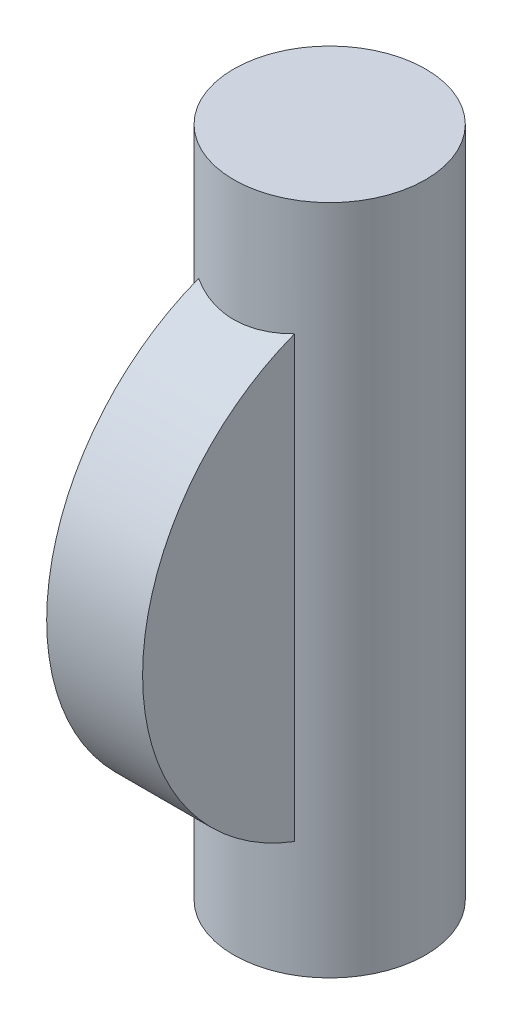
ISO-10303-21;
HEADER;
FILE_DESCRIPTION(('STEP AP214'),'2;1');
FILE_NAME('part.step','',(''),(''),'','','');
FILE_SCHEMA(('AUTOMOTIVE_DESIGN { 1 0 10303 214 1 1 1 1 }'));
ENDSEC;
DATA;
#1=APPLICATION_CONTEXT('core data for automotive mechanical design processes');
#2=APPLICATION_PROTOCOL_DEFINITION('international standard','automotive_design',2000,#1);
#3=PRODUCT_CONTEXT('',#1,'mechanical');
#4=PRODUCT('Part','Part','',(#3));
#5=PRODUCT_RELATED_PRODUCT_CATEGORY('part','',(#4));
#6=PRODUCT_DEFINITION_FORMATION('','',#4);
#7=PRODUCT_DEFINITION_CONTEXT('part definition',#1,'design');
#8=PRODUCT_DEFINITION('design','',#6,#7);
#9=PRODUCT_DEFINITION_SHAPE('','',#8);
#10=(LENGTH_UNIT() NAMED_UNIT(*) SI_UNIT(.MILLI.,.METRE.));
#11=(NAMED_UNIT(*) PLANE_ANGLE_UNIT() SI_UNIT($,.RADIAN.));
#12=(NAMED_UNIT(*) SI_UNIT($,.STERADIAN.) SOLID_ANGLE_UNIT());
#13=UNCERTAINTY_MEASURE_WITH_UNIT(LENGTH_MEASURE(1.E-05),#10,'distance_accuracy_value','');
#14=(GEOMETRIC_REPRESENTATION_CONTEXT(3) GLOBAL_UNCERTAINTY_ASSIGNED_CONTEXT((#13)) GLOBAL_UNIT_ASSIGNED_CONTEXT((#10,
#11,#12)) REPRESENTATION_CONTEXT('',''));
#15=CARTESIAN_POINT('',(0.,0.,0.));
#16=DIRECTION('',(0.,0.,1.));
#17=DIRECTION('',(1.,0.,0.));
#18=AXIS2_PLACEMENT_3D('',#15,#16,#17);
#19=CARTESIAN_POINT('',(0.,17.78,0.));
#20=DIRECTION('',(0.,-1.,0.));
#21=DIRECTION('',(0.,0.,-1.));
#22=AXIS2_PLACEMENT_3D('',#19,#20,#21);
#23=CYLINDRICAL_SURFACE('',#22,2.54);
#24=CARTESIAN_POINT('',(0.,0.,0.));
#25=DIRECTION('',(0.,1.,0.));
#26=DIRECTION('',(0.,0.,1.));
#27=AXIS2_PLACEMENT_3D('',#24,#25,#26);
#28=CIRCLE('',#27,2.54);
#29=CARTESIAN_POINT('',(0.,0.,2.54));
#30=VERTEX_POINT('',#29);
#31=EDGE_CURVE('E101',#30,#30,#28,.T.);
#32=ORIENTED_EDGE('',*,*,#31,.T.);
#33=EDGE_LOOP('',(#32));
#34=FACE_BOUND('',#33,.T.);
#35=CARTESIAN_POINT('',(0.,17.78,0.));
#36=DIRECTION('',(0.,1.,0.));
#37=DIRECTION('',(0.,0.,1.));
#38=AXIS2_PLACEMENT_3D('',#35,#36,#37);
#39=CIRCLE('',#38,2.54);
#40=CARTESIAN_POINT('',(0.,17.78,2.54));
#41=VERTEX_POINT('',#40);
#42=EDGE_CURVE('E65',#41,#41,#39,.T.);
#43=ORIENTED_EDGE('',*,*,#42,.F.);
#44=EDGE_LOOP('',(#43));
#45=FACE_BOUND('',#44,.T.);
#46=DIRECTION('',(0.,-1.,0.));
#47=VECTOR('',#46,1.);
#48=CARTESIAN_POINT('',(-1.27,17.78,2.19970452561247));
#49=LINE('',#48,#47);
#50=CARTESIAN_POINT('',(-1.27,14.7112566512738,2.19970452561247));
#51=VERTEX_POINT('',#50);
#52=CARTESIAN_POINT('',(-1.27,3.06874334872615,2.19970452561247));
#53=VERTEX_POINT('',#52);
#54=EDGE_CURVE('E11',#51,#53,#49,.T.);
#55=ORIENTED_EDGE('',*,*,#54,.F.);
#56=CARTESIAN_POINT('',(0.,14.5710323885716,-2.54));
#57=CARTESIAN_POINT('',(-0.0679155655720305,14.5710337146344,-2.53999844050646));
#58=CARTESIAN_POINT('',(-0.135853569762148,14.5722558814735,-2.5372703167691));
#59=CARTESIAN_POINT('',(-0.271221226461333,14.5770987997238,-2.52639338906266));
#60=CARTESIAN_POINT('',(-0.338650534826577,14.5807210493114,-2.51824119927744));
#61=CARTESIAN_POINT('',(-0.539693567418974,14.5950507345168,-2.48570637087482));
#62=CARTESIAN_POINT('',(-0.671856275803724,14.6092205973638,-2.45324576747276));
#63=CARTESIAN_POINT('',(-0.927802215521276,14.6448991388758,-2.36831960375434));
#64=CARTESIAN_POINT('',(-1.05161640518304,14.6663786878879,-2.31593335260028));
#65=CARTESIAN_POINT('',(-1.28869168847588,14.7142056937984,-2.1928755843071));
#66=CARTESIAN_POINT('',(-1.40195556531598,14.7405518613638,-2.12220890829366));
#67=CARTESIAN_POINT('',(-1.62150470841532,14.796905118006,-1.96008701428142));
#68=CARTESIAN_POINT('',(-1.72708119218214,14.8270331416588,-1.86771414327507));
#69=CARTESIAN_POINT('',(-1.92176793364219,14.8865587708278,-1.66673065906509));
#70=CARTESIAN_POINT('',(-2.01087199039026,14.9159560976877,-1.55811395869108));
#71=CARTESIAN_POINT('',(-2.17364166423992,14.9721676220868,-1.32221208425154));
#72=CARTESIAN_POINT('',(-2.2465170854779,14.9988248607961,-1.19434091167574));
#73=CARTESIAN_POINT('',(-2.36941848184901,15.0450806010899,-0.926870737178497));
#74=CARTESIAN_POINT('',(-2.41945421228399,15.0646821155616,-0.787276772523779));
#75=CARTESIAN_POINT('',(-2.49270943847994,15.0937614377408,-0.507753572710938));
#76=CARTESIAN_POINT('',(-2.51714855260971,15.1036978850658,-0.368192644665041));
#77=CARTESIAN_POINT('',(-2.5424507266891,15.113989234143,-0.0866206654972092));
#78=CARTESIAN_POINT('',(-2.54332294328488,15.1143478572478,0.055389412574953));
#79=CARTESIAN_POINT('',(-2.52212084700829,15.1057178466232,0.328987264892486));
#80=CARTESIAN_POINT('',(-2.50138464934366,15.0972742820658,0.460699094257686));
#81=CARTESIAN_POINT('',(-2.439839015735,15.0727300484544,0.718584032260553));
#82=CARTESIAN_POINT('',(-2.39902810355434,15.0566288162804,0.844756732823289));
#83=CARTESIAN_POINT('',(-2.2979971107209,15.018026997958,1.09027772930769));
#84=CARTESIAN_POINT('',(-2.23749181564043,14.9954329839583,1.20949336387334));
#85=CARTESIAN_POINT('',(-2.09906256194394,14.9460726742474,1.43638950208111));
#86=CARTESIAN_POINT('',(-2.02113253626385,14.9193049262813,1.54406596857104));
#87=CARTESIAN_POINT('',(-1.84389463407868,14.8621500462067,1.75260593970079));
#88=CARTESIAN_POINT('',(-1.74349322636959,14.8316405704135,1.85250789705647));
#89=CARTESIAN_POINT('',(-1.52726700447751,14.771827131676,2.03446104003705));
#90=CARTESIAN_POINT('',(-1.41143673533339,14.7425235999187,2.11650588503086));
#91=CARTESIAN_POINT('',(-1.16316739109928,14.6875876073813,2.2627442198456));
#92=CARTESIAN_POINT('',(-1.03032998669366,14.6620940949051,2.32631808932677));
#93=CARTESIAN_POINT('',(-0.754517305525141,14.619305635495,2.42980640316843));
#94=CARTESIAN_POINT('',(-0.611549010205899,14.6020051045438,2.46973696654542));
#95=CARTESIAN_POINT('',(-0.329147462582528,14.5789308837986,2.52241458803907));
#96=CARTESIAN_POINT('',(-0.190058492382774,14.5724999602969,2.53671503178177));
#97=CARTESIAN_POINT('',(0.0886502374134904,14.5700173496361,2.5422726995924));
#98=CARTESIAN_POINT('',(0.228269810786092,14.5739623061763,2.53353737507082));
#99=CARTESIAN_POINT('',(0.495209720900547,14.5911102171483,2.49468747082768));
#100=CARTESIAN_POINT('',(0.622763850287883,14.6037401802841,2.46589472097989));
#101=CARTESIAN_POINT('',(0.871136249198154,14.6361138116632,2.38947987804791));
#102=CARTESIAN_POINT('',(0.991952978965018,14.6558590984014,2.34185350071161));
#103=CARTESIAN_POINT('',(1.22901300437097,14.7012381958511,2.22692523872823));
#104=CARTESIAN_POINT('',(1.34485897936801,14.7270822128168,2.15888944130358));
#105=CARTESIAN_POINT('',(1.56403169452064,14.7814369151021,2.00581403664751));
#106=CARTESIAN_POINT('',(1.66735314815108,14.809948717543,1.92076728905676));
#107=CARTESIAN_POINT('',(1.86687262430553,14.8690939208298,1.72830846859012));
#108=CARTESIAN_POINT('',(1.96189793766413,14.8997204897089,1.61967386773864));
#109=CARTESIAN_POINT('',(2.13256590216446,14.9575784688431,1.38727905242237));
#110=CARTESIAN_POINT('',(2.20820746607035,14.9848096886087,1.26351799008813));
#111=CARTESIAN_POINT('',(2.33777217276902,15.0329371159256,1.00374227729909));
#112=CARTESIAN_POINT('',(2.39167216045291,15.0538265635689,0.867714750467775));
#113=CARTESIAN_POINT('',(2.47544998172956,15.0868123346982,0.587456059343264));
#114=CARTESIAN_POINT('',(2.50534147028115,15.0989136561007,0.443229608287135));
#115=CARTESIAN_POINT('',(2.53858499876886,15.1124059799847,0.161173246470499));
#116=CARTESIAN_POINT('',(2.54359282121928,15.1144650193544,0.0235690280902437));
#117=CARTESIAN_POINT('',(2.53133776401006,15.1094666923652,-0.250460098207927));
#118=CARTESIAN_POINT('',(2.51407851578016,15.1024108125145,-0.386885194770715));
#119=CARTESIAN_POINT('',(2.45896598832264,15.0803181645393,-0.650056335900987));
#120=CARTESIAN_POINT('',(2.42181101094947,15.0655524120803,-0.776973219254644));
#121=CARTESIAN_POINT('',(2.32870899128387,15.0296396812099,-1.02273778875243));
#122=CARTESIAN_POINT('',(2.27275830729747,15.0084914662684,-1.14158390580604));
#123=CARTESIAN_POINT('',(2.14084126582143,14.9606992555846,-1.37368410803692));
#124=CARTESIAN_POINT('',(2.06409124205232,14.9338516719614,-1.48644994259519));
#125=CARTESIAN_POINT('',(1.89391799156258,14.8778711098137,-1.69797511038717));
#126=CARTESIAN_POINT('',(1.80048889419718,14.8487373286311,-1.79672948987847));
#127=CARTESIAN_POINT('',(1.59244516940227,14.7891073791391,-1.98407386269434));
#128=CARTESIAN_POINT('',(1.47684999916146,14.7586452708256,-2.07159044676929));
#129=CARTESIAN_POINT('',(1.23167420488724,14.7017921938346,-2.22611785611173));
#130=CARTESIAN_POINT('',(1.10208598244594,14.6754034561361,-2.29311746388533));
#131=CARTESIAN_POINT('',(0.833091202587661,14.630281944911,-2.40384873592657));
#132=CARTESIAN_POINT('',(0.693767323679287,14.6114921571685,-2.44775444961009));
#133=CARTESIAN_POINT('',(0.480350707210397,14.5908604932617,-2.49523331886032));
#134=CARTESIAN_POINT('',(0.408544639657021,14.5852438941032,-2.50799285370647));
#135=CARTESIAN_POINT('',(0.263959935422451,14.5767057794607,-2.5272963752547));
#136=CARTESIAN_POINT('',(0.191182047763726,14.5737822976096,-2.53384489700239));
#137=CARTESIAN_POINT('',(0.0788688337448351,14.5714425235546,-2.53908239685828));
#138=CARTESIAN_POINT('',(0.0394382000927927,14.5710316185342,-2.54000090558943));
#139=CARTESIAN_POINT('',(0.,14.5710323885716,-2.54));
#140=B_SPLINE_CURVE_WITH_KNOTS('',3,(#56,#57,#58,#59,#60,#61,#62,#63,#64,#65,#66,#67,#68,#69,
#70,#71,#72,#73,#74,#75,#76,#77,#78,#79,#80,#81,#82,#83,#84,#85,#86,#87,#88,#89,#90,#91,#92,#93,
#94,#95,#96,#97,#98,#99,#100,#101,#102,#103,#104,#105,#106,#107,#108,#109,#110,#111,#112,#113,
#114,#115,#116,#117,#118,#119,#120,#121,#122,#123,#124,#125,#126,#127,#128,#129,#130,#131,#132,
#133,#134,#135,#136,#137,#138,#139),.UNSPECIFIED.,.T.,.F.,(4,2,2,2,2,2,2,2,2,2,2,2,2,2,2,2,2,2,
2,2,2,2,2,2,2,2,2,2,2,2,2,2,2,2,2,2,2,2,2,2,2,4),(0.,0.203712638649048,0.407552558463175,
0.815842424343114,1.22252391578538,1.62909781759079,2.05766182477721,2.48638683522042,
2.93282955331532,3.37908140770325,3.80294093161042,4.22663576742006,4.62556804368743,
5.02452966067109,5.42954723849084,5.8347060583643,6.26742266193142,6.70029266299863,
7.14634307038392,7.59208902808188,8.00976688987415,8.42730966142889,8.81965788287157,
9.21209540662931,9.62080420686393,10.0296849243162,10.4702551126703,10.9108500072302,
11.3519129109091,11.7927247797753,12.2037708224221,12.6147498380145,13.0121683707442,
13.4096639483132,13.8249477080811,14.2403779272758,14.6827295341247,15.1253225631624,
15.5645303398846,15.7837125088946,16.0027345159338,16.1210293388777),.UNSPECIFIED.);
#141=CARTESIAN_POINT('',(1.27,14.7112566512738,2.19970452561247));
#142=VERTEX_POINT('',#141);
#143=EDGE_CURVE('E41',#51,#142,#140,.T.);
#144=ORIENTED_EDGE('',*,*,#143,.T.);
#145=DIRECTION('',(0.,-1.,0.));
#146=VECTOR('',#145,1.);
#147=CARTESIAN_POINT('',(1.27,17.78,2.19970452561247));
#148=LINE('',#147,#146);
#149=CARTESIAN_POINT('',(1.27,3.06874334872615,2.19970452561247));
#150=VERTEX_POINT('',#149);
#151=EDGE_CURVE('E59',#142,#150,#148,.T.);
#152=ORIENTED_EDGE('',*,*,#151,.T.);
#153=CARTESIAN_POINT('',(0.,3.20896761142836,-2.54));
#154=CARTESIAN_POINT('',(0.0679155655720305,3.20896628536558,-2.53999844050646));
#155=CARTESIAN_POINT('',(0.135853569762148,3.20774411852652,-2.5372703167691));
#156=CARTESIAN_POINT('',(0.271221226461333,3.20290120027615,-2.52639338906266));
#157=CARTESIAN_POINT('',(0.338650534826577,3.19927895068856,-2.51824119927744));
#158=CARTESIAN_POINT('',(0.539693567418974,3.1849492654832,-2.48570637087482));
#159=CARTESIAN_POINT('',(0.671856275803724,3.17077940263624,-2.45324576747276));
#160=CARTESIAN_POINT('',(0.927802215521276,3.13510086112424,-2.36831960375434));
#161=CARTESIAN_POINT('',(1.05161640518305,3.11362131211208,-2.31593335260028));
#162=CARTESIAN_POINT('',(1.28869168847588,3.0657943062016,-2.1928755843071));
#163=CARTESIAN_POINT('',(1.40195556531598,3.03944813863619,-2.12220890829366));
#164=CARTESIAN_POINT('',(1.62150470841532,2.98309488199399,-1.96008701428142));
#165=CARTESIAN_POINT('',(1.72708119218214,2.95296685834115,-1.86771414327507));
#166=CARTESIAN_POINT('',(1.92176793364219,2.8934412291722,-1.66673065906509));
#167=CARTESIAN_POINT('',(2.01087199039026,2.86404390231228,-1.55811395869108));
#168=CARTESIAN_POINT('',(2.17364166423992,2.80783237791321,-1.32221208425154));
#169=CARTESIAN_POINT('',(2.2465170854779,2.78117513920386,-1.19434091167574));
#170=CARTESIAN_POINT('',(2.36941848184901,2.73491939891005,-0.926870737178496));
#171=CARTESIAN_POINT('',(2.419454212284,2.71531788443841,-0.787276772523779));
#172=CARTESIAN_POINT('',(2.49270943847994,2.68623856225916,-0.507753572710937));
#173=CARTESIAN_POINT('',(2.51714855260971,2.67630211493422,-0.368192644665041));
#174=CARTESIAN_POINT('',(2.5424507266891,2.66601076585697,-0.0866206654972092));
#175=CARTESIAN_POINT('',(2.54332294328488,2.66565214275218,0.0553894125749528));
#176=CARTESIAN_POINT('',(2.52212084700829,2.67428215337685,0.328987264892486));
#177=CARTESIAN_POINT('',(2.50138464934366,2.68272571793417,0.460699094257686));
#178=CARTESIAN_POINT('',(2.439839015735,2.7072699515456,0.718584032260553));
#179=CARTESIAN_POINT('',(2.39902810355434,2.72337118371963,0.844756732823289));
#180=CARTESIAN_POINT('',(2.2979971107209,2.76197300204203,1.09027772930769));
#181=CARTESIAN_POINT('',(2.23749181564043,2.78456701604172,1.20949336387334));
#182=CARTESIAN_POINT('',(2.09906256194394,2.83392732575261,1.43638950208111));
#183=CARTESIAN_POINT('',(2.02113253626385,2.8606950737187,1.54406596857104));
#184=CARTESIAN_POINT('',(1.84389463407868,2.91784995379334,1.75260593970079));
#185=CARTESIAN_POINT('',(1.74349322636959,2.94835942958653,1.85250789705647));
#186=CARTESIAN_POINT('',(1.52726700447751,3.00817286832399,2.03446104003705));
#187=CARTESIAN_POINT('',(1.41143673533339,3.03747640008134,2.11650588503086));
#188=CARTESIAN_POINT('',(1.16316739109928,3.09241239261871,2.2627442198456));
#189=CARTESIAN_POINT('',(1.03032998669366,3.11790590509489,2.32631808932677));
#190=CARTESIAN_POINT('',(0.75451730552514,3.16069436450505,2.42980640316843));
#191=CARTESIAN_POINT('',(0.611549010205898,3.17799489545622,2.46973696654542));
#192=CARTESIAN_POINT('',(0.329147462582527,3.20106911620144,2.52241458803907));
#193=CARTESIAN_POINT('',(0.190058492382773,3.20750003970313,2.53671503178177));
#194=CARTESIAN_POINT('',(-0.0886502374134913,3.20998265036389,2.5422726995924));
#195=CARTESIAN_POINT('',(-0.228269810786092,3.20603769382372,2.53353737507082));
#196=CARTESIAN_POINT('',(-0.495209720900548,3.18888978285172,2.49468747082768));
#197=CARTESIAN_POINT('',(-0.622763850287883,3.17625981971587,2.46589472097989));
#198=CARTESIAN_POINT('',(-0.871136249198155,3.14388618833679,2.38947987804791));
#199=CARTESIAN_POINT('',(-0.991952978965019,3.1241409015986,2.34185350071161));
#200=CARTESIAN_POINT('',(-1.22901300437097,3.07876180414892,2.22692523872823));
#201=CARTESIAN_POINT('',(-1.34485897936801,3.05291778718321,2.15888944130358));
#202=CARTESIAN_POINT('',(-1.56403169452064,2.99856308489791,2.00581403664751));
#203=CARTESIAN_POINT('',(-1.66735314815108,2.97005128245701,1.92076728905676));
#204=CARTESIAN_POINT('',(-1.86687262430553,2.91090607917022,1.72830846859012));
#205=CARTESIAN_POINT('',(-1.96189793766413,2.88027951029106,1.61967386773863));
#206=CARTESIAN_POINT('',(-2.13256590216446,2.82242153115692,1.38727905242237));
#207=CARTESIAN_POINT('',(-2.20820746607035,2.79519031139126,1.26351799008813));
#208=CARTESIAN_POINT('',(-2.33777217276902,2.74706288407437,1.00374227729909));
#209=CARTESIAN_POINT('',(-2.39167216045292,2.72617343643106,0.867714750467774));
#210=CARTESIAN_POINT('',(-2.47544998172956,2.69318766530181,0.587456059343262));
#211=CARTESIAN_POINT('',(-2.50534147028115,2.68108634389925,0.443229608287134));
#212=CARTESIAN_POINT('',(-2.53858499876886,2.66759402001528,0.161173246470498));
#213=CARTESIAN_POINT('',(-2.54359282121928,2.66553498064558,0.0235690280902428));
#214=CARTESIAN_POINT('',(-2.53133776401006,2.67053330763479,-0.250460098207928));
#215=CARTESIAN_POINT('',(-2.51407851578016,2.67758918748548,-0.386885194770716));
#216=CARTESIAN_POINT('',(-2.45896598832264,2.69968183546067,-0.650056335900988));
#217=CARTESIAN_POINT('',(-2.42181101094947,2.71444758791968,-0.776973219254645));
#218=CARTESIAN_POINT('',(-2.32870899128387,2.75036031879008,-1.02273778875243));
#219=CARTESIAN_POINT('',(-2.27275830729747,2.77150853373157,-1.14158390580604));
#220=CARTESIAN_POINT('',(-2.14084126582142,2.81930074441536,-1.37368410803692));
#221=CARTESIAN_POINT('',(-2.06409124205232,2.84614832803862,-1.48644994259519));
#222=CARTESIAN_POINT('',(-1.89391799156258,2.90212889018633,-1.69797511038717));
#223=CARTESIAN_POINT('',(-1.80048889419718,2.93126267136891,-1.79672948987847));
#224=CARTESIAN_POINT('',(-1.59244516940227,2.99089262086089,-1.98407386269434));
#225=CARTESIAN_POINT('',(-1.47684999916146,3.02135472917436,-2.07159044676929));
#226=CARTESIAN_POINT('',(-1.23167420488724,3.07820780616539,-2.22611785611173));
#227=CARTESIAN_POINT('',(-1.10208598244594,3.10459654386391,-2.29311746388533));
#228=CARTESIAN_POINT('',(-0.83309120258766,3.14971805508903,-2.40384873592657));
#229=CARTESIAN_POINT('',(-0.693767323679285,3.16850784283148,-2.44775444961008));
#230=CARTESIAN_POINT('',(-0.480350707210395,3.18913950673831,-2.49523331886032));
#231=CARTESIAN_POINT('',(-0.408544639657019,3.19475610589675,-2.50799285370647));
#232=CARTESIAN_POINT('',(-0.263959935422449,3.20329422053931,-2.5272963752547));
#233=CARTESIAN_POINT('',(-0.191182047763724,3.20621770239039,-2.53384489700239));
#234=CARTESIAN_POINT('',(-0.0788688337448337,3.20855747644539,-2.53908239685828));
#235=CARTESIAN_POINT('',(-0.039438200092792,3.20896838146581,-2.54000090558943));
#236=CARTESIAN_POINT('',(0.,3.20896761142836,-2.54));
#237=B_SPLINE_CURVE_WITH_KNOTS('',3,(#153,#154,#155,#156,#157,#158,#159,#160,#161,#162,#163,
#164,#165,#166,#167,#168,#169,#170,#171,#172,#173,#174,#175,#176,#177,#178,#179,#180,#181,#182,
#183,#184,#185,#186,#187,#188,#189,#190,#191,#192,#193,#194,#195,#196,#197,#198,#199,#200,#201,
#202,#203,#204,#205,#206,#207,#208,#209,#210,#211,#212,#213,#214,#215,#216,#217,#218,#219,#220,
#221,#222,#223,#224,#225,#226,#227,#228,#229,#230,#231,#232,#233,#234,#235,#236),.UNSPECIFIED.,
.T.,.F.,(4,2,2,2,2,2,2,2,2,2,2,2,2,2,2,2,2,2,2,2,2,2,2,2,2,2,2,2,2,2,2,2,2,2,2,2,2,2,2,2,2,4),
(0.,0.203712638649048,0.407552558463175,0.815842424343114,1.22252391578538,1.62909781759079,
2.05766182477721,2.48638683522042,2.93282955331532,3.37908140770325,3.80294093161042,
4.22663576742006,4.62556804368742,5.02452966067109,5.42954723849084,5.8347060583643,
6.26742266193142,6.70029266299862,7.14634307038392,7.59208902808188,8.00976688987415,
8.42730966142889,8.81965788287157,9.21209540662931,9.62080420686393,10.0296849243162,
10.4702551126703,10.9108500072302,11.3519129109091,11.7927247797753,12.2037708224221,
12.6147498380145,13.0121683707442,13.4096639483132,13.8249477080811,14.2403779272758,
14.6827295341247,15.1253225631624,15.5645303398846,15.7837125088946,16.0027345159338,
16.1210293388776),.UNSPECIFIED.);
#238=EDGE_CURVE('E64',#150,#53,#237,.T.);
#239=ORIENTED_EDGE('',*,*,#238,.T.);
#240=EDGE_LOOP('',(#55,#144,#152,#239));
#241=FACE_BOUND('',#240,.T.);
#242=ADVANCED_FACE('F33',(#34,#45,#241),#23,.T.);
#243=CARTESIAN_POINT('',(0.,17.78,0.));
#244=DIRECTION('',(0.,1.,0.));
#245=DIRECTION('',(0.,0.,1.));
#246=AXIS2_PLACEMENT_3D('',#243,#244,#245);
#247=PLANE('',#246);
#248=ORIENTED_EDGE('',*,*,#42,.T.);
#249=EDGE_LOOP('',(#248));
#250=FACE_BOUND('',#249,.T.);
#251=ADVANCED_FACE('F86',(#250),#247,.T.);
#252=CARTESIAN_POINT('',(0.,0.,0.));
#253=DIRECTION('',(0.,1.,0.));
#254=DIRECTION('',(0.,0.,1.));
#255=AXIS2_PLACEMENT_3D('',#252,#253,#254);
#256=PLANE('',#255);
#257=ORIENTED_EDGE('',*,*,#31,.F.);
#258=EDGE_LOOP('',(#257));
#259=FACE_BOUND('',#258,.T.);
#260=ADVANCED_FACE('F84',(#259),#256,.F.);
#261=CARTESIAN_POINT('',(-1.27,8.89,0.));
#262=DIRECTION('',(1.,0.,0.));
#263=DIRECTION('',(0.,0.,-1.));
#264=AXIS2_PLACEMENT_3D('',#261,#262,#263);
#265=CYLINDRICAL_SURFACE('',#264,6.223);
#266=ORIENTED_EDGE('',*,*,#143,.F.);
#267=CARTESIAN_POINT('',(-1.27,8.89,0.));
#268=DIRECTION('',(1.,0.,0.));
#269=DIRECTION('',(0.,0.,-1.));
#270=AXIS2_PLACEMENT_3D('',#267,#268,#269);
#271=CIRCLE('',#270,6.223);
#272=EDGE_CURVE('E69',#51,#53,#271,.T.);
#273=ORIENTED_EDGE('',*,*,#272,.T.);
#274=ORIENTED_EDGE('',*,*,#238,.F.);
#275=CARTESIAN_POINT('',(1.27,8.89,0.));
#276=DIRECTION('',(1.,0.,0.));
#277=DIRECTION('',(0.,0.,-1.));
#278=AXIS2_PLACEMENT_3D('',#275,#276,#277);
#279=CIRCLE('',#278,6.223);
#280=EDGE_CURVE('E47',#142,#150,#279,.T.);
#281=ORIENTED_EDGE('',*,*,#280,.F.);
#282=EDGE_LOOP('',(#266,#273,#274,#281));
#283=FACE_BOUND('',#282,.T.);
#284=ADVANCED_FACE('F68',(#283),#265,.T.);
#285=CARTESIAN_POINT('',(-1.27,0.,0.));
#286=DIRECTION('',(1.,0.,0.));
#287=DIRECTION('',(0.,0.,-1.));
#288=AXIS2_PLACEMENT_3D('',#285,#286,#287);
#289=PLANE('',#288);
#290=ORIENTED_EDGE('',*,*,#272,.F.);
#291=ORIENTED_EDGE('',*,*,#54,.T.);
#292=EDGE_LOOP('',(#290,#291));
#293=FACE_BOUND('',#292,.T.);
#294=ADVANCED_FACE('F83',(#293),#289,.F.);
#295=CARTESIAN_POINT('',(1.27,0.,0.));
#296=DIRECTION('',(1.,0.,0.));
#297=DIRECTION('',(0.,0.,-1.));
#298=AXIS2_PLACEMENT_3D('',#295,#296,#297);
#299=PLANE('',#298);
#300=ORIENTED_EDGE('',*,*,#151,.F.);
#301=ORIENTED_EDGE('',*,*,#280,.T.);
#302=EDGE_LOOP('',(#300,#301));
#303=FACE_BOUND('',#302,.T.);
#304=ADVANCED_FACE('F60',(#303),#299,.T.);
#305=CLOSED_SHELL('',(#242,#251,#260,#284,#294,#304));
#306=MANIFOLD_SOLID_BREP('B2',#305);
#307=ADVANCED_BREP_SHAPE_REPRESENTATION('',(#18,#306),#14);
#308=SHAPE_DEFINITION_REPRESENTATION(#9,#307);
ENDSEC;
END-ISO-10303-21;
